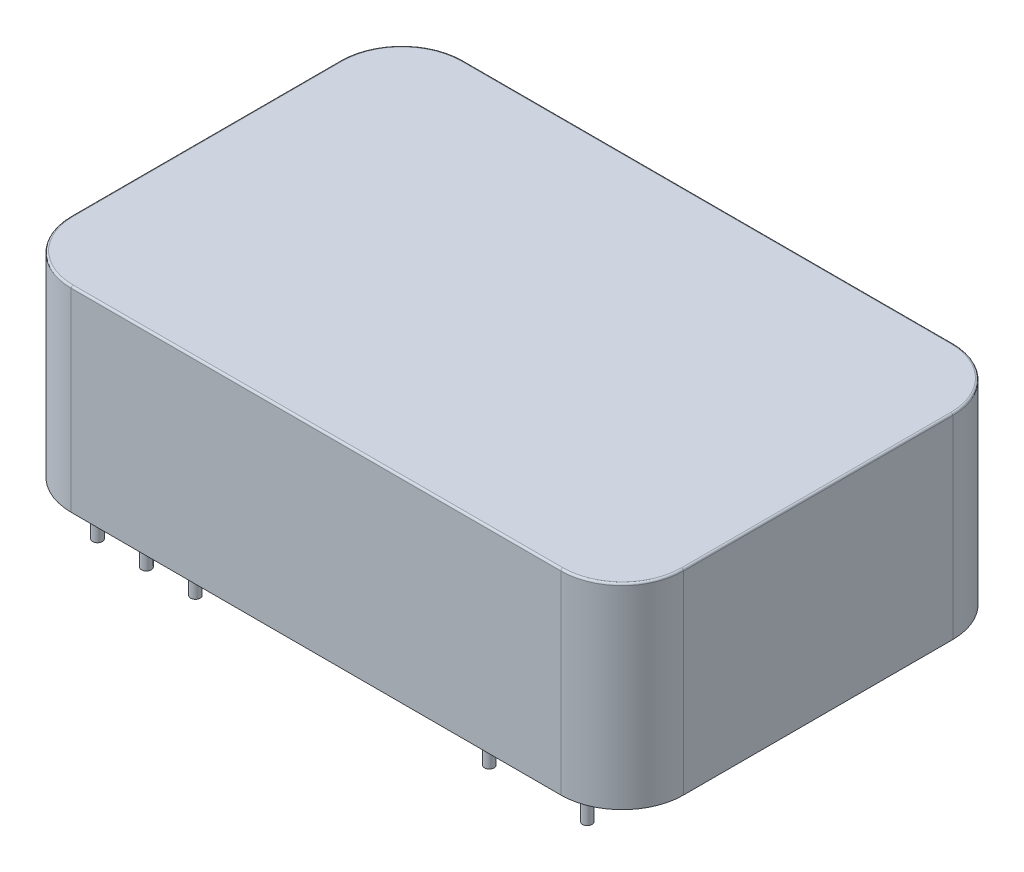
ISO-10303-21;
HEADER;
FILE_DESCRIPTION(('STEP AP214'),'2;1');
FILE_NAME('part.step','',(''),(''),'','','');
FILE_SCHEMA(('AUTOMOTIVE_DESIGN { 1 0 10303 214 1 1 1 1 }'));
ENDSEC;
DATA;
#1=APPLICATION_CONTEXT('core data for automotive mechanical design processes');
#2=APPLICATION_PROTOCOL_DEFINITION('international standard','automotive_design',2000,#1);
#3=PRODUCT_CONTEXT('',#1,'mechanical');
#4=PRODUCT('Part','Part','',(#3));
#5=PRODUCT_RELATED_PRODUCT_CATEGORY('part','',(#4));
#6=PRODUCT_DEFINITION_FORMATION('','',#4);
#7=PRODUCT_DEFINITION_CONTEXT('part definition',#1,'design');
#8=PRODUCT_DEFINITION('design','',#6,#7);
#9=PRODUCT_DEFINITION_SHAPE('','',#8);
#10=(LENGTH_UNIT() NAMED_UNIT(*) SI_UNIT(.MILLI.,.METRE.));
#11=(NAMED_UNIT(*) PLANE_ANGLE_UNIT() SI_UNIT($,.RADIAN.));
#12=(NAMED_UNIT(*) SI_UNIT($,.STERADIAN.) SOLID_ANGLE_UNIT());
#13=UNCERTAINTY_MEASURE_WITH_UNIT(LENGTH_MEASURE(1.E-05),#10,'distance_accuracy_value','');
#14=(GEOMETRIC_REPRESENTATION_CONTEXT(3) GLOBAL_UNCERTAINTY_ASSIGNED_CONTEXT((#13)) GLOBAL_UNIT_ASSIGNED_CONTEXT((#10,
#11,#12)) REPRESENTATION_CONTEXT('',''));
#15=CARTESIAN_POINT('',(0.,0.,0.));
#16=DIRECTION('',(0.,0.,1.));
#17=DIRECTION('',(1.,0.,0.));
#18=AXIS2_PLACEMENT_3D('',#15,#16,#17);
#19=CARTESIAN_POINT('',(-15.875,10.16,-10.16));
#20=DIRECTION('',(1.,0.,0.));
#21=DIRECTION('',(0.,0.,-1.));
#22=AXIS2_PLACEMENT_3D('',#19,#20,#21);
#23=PLANE('',#22);
#24=DIRECTION('',(0.,-1.,0.));
#25=VECTOR('',#24,1.);
#26=CARTESIAN_POINT('',(-15.875,10.16,6.98));
#27=LINE('',#26,#25);
#28=CARTESIAN_POINT('',(-15.875,0.,6.98));
#29=VERTEX_POINT('',#28);
#30=CARTESIAN_POINT('',(-15.875,10.06,6.98));
#31=VERTEX_POINT('',#30);
#32=EDGE_CURVE('E181',#29,#31,#27,.F.);
#33=ORIENTED_EDGE('',*,*,#32,.T.);
#34=DIRECTION('',(0.,0.,1.));
#35=VECTOR('',#34,1.);
#36=CARTESIAN_POINT('',(-15.875,10.06,-10.16));
#37=LINE('',#36,#35);
#38=CARTESIAN_POINT('',(-15.875,10.06,-6.98));
#39=VERTEX_POINT('',#38);
#40=EDGE_CURVE('E223',#31,#39,#37,.F.);
#41=ORIENTED_EDGE('',*,*,#40,.T.);
#42=DIRECTION('',(0.,-1.,0.));
#43=VECTOR('',#42,1.);
#44=CARTESIAN_POINT('',(-15.875,10.16,-6.98));
#45=LINE('',#44,#43);
#46=CARTESIAN_POINT('',(-15.875,0.,-6.98));
#47=VERTEX_POINT('',#46);
#48=EDGE_CURVE('E185',#39,#47,#45,.T.);
#49=ORIENTED_EDGE('',*,*,#48,.T.);
#50=DIRECTION('',(0.,0.,1.));
#51=VECTOR('',#50,1.);
#52=CARTESIAN_POINT('',(-15.875,0.,-10.16));
#53=LINE('',#52,#51);
#54=EDGE_CURVE('E338',#47,#29,#53,.T.);
#55=ORIENTED_EDGE('',*,*,#54,.T.);
#56=EDGE_LOOP('',(#33,#41,#49,#55));
#57=FACE_BOUND('',#56,.T.);
#58=ADVANCED_FACE('F39',(#57),#23,.F.);
#59=CARTESIAN_POINT('',(15.875,10.16,10.16));
#60=DIRECTION('',(0.,0.,-1.));
#61=DIRECTION('',(-1.,0.,0.));
#62=AXIS2_PLACEMENT_3D('',#59,#60,#61);
#63=PLANE('',#62);
#64=DIRECTION('',(0.,-1.,0.));
#65=VECTOR('',#64,1.);
#66=CARTESIAN_POINT('',(12.695,10.16,10.16));
#67=LINE('',#66,#65);
#68=CARTESIAN_POINT('',(12.695,0.,10.16));
#69=VERTEX_POINT('',#68);
#70=CARTESIAN_POINT('',(12.695,10.06,10.16));
#71=VERTEX_POINT('',#70);
#72=EDGE_CURVE('E177',#69,#71,#67,.F.);
#73=ORIENTED_EDGE('',*,*,#72,.T.);
#74=DIRECTION('',(1.,0.,0.));
#75=VECTOR('',#74,1.);
#76=CARTESIAN_POINT('',(15.875,10.06,10.16));
#77=LINE('',#76,#75);
#78=CARTESIAN_POINT('',(-12.695,10.06,10.16));
#79=VERTEX_POINT('',#78);
#80=EDGE_CURVE('E217',#71,#79,#77,.F.);
#81=ORIENTED_EDGE('',*,*,#80,.T.);
#82=DIRECTION('',(0.,-1.,0.));
#83=VECTOR('',#82,1.);
#84=CARTESIAN_POINT('',(-12.695,10.16,10.16));
#85=LINE('',#84,#83);
#86=CARTESIAN_POINT('',(-12.695,0.,10.16));
#87=VERTEX_POINT('',#86);
#88=EDGE_CURVE('E174',#79,#87,#85,.T.);
#89=ORIENTED_EDGE('',*,*,#88,.T.);
#90=DIRECTION('',(1.,0.,0.));
#91=VECTOR('',#90,1.);
#92=CARTESIAN_POINT('',(15.875,0.,10.16));
#93=LINE('',#92,#91);
#94=EDGE_CURVE('E160',#87,#69,#93,.T.);
#95=ORIENTED_EDGE('',*,*,#94,.T.);
#96=EDGE_LOOP('',(#73,#81,#89,#95));
#97=FACE_BOUND('',#96,.T.);
#98=ADVANCED_FACE('F349',(#97),#63,.F.);
#99=CARTESIAN_POINT('',(15.875,10.16,-10.16));
#100=DIRECTION('',(-1.,0.,0.));
#101=DIRECTION('',(0.,0.,1.));
#102=AXIS2_PLACEMENT_3D('',#99,#100,#101);
#103=PLANE('',#102);
#104=DIRECTION('',(0.,-1.,0.));
#105=VECTOR('',#104,1.);
#106=CARTESIAN_POINT('',(15.875,10.16,-6.98));
#107=LINE('',#106,#105);
#108=CARTESIAN_POINT('',(15.875,0.,-6.98));
#109=VERTEX_POINT('',#108);
#110=CARTESIAN_POINT('',(15.875,10.06,-6.98));
#111=VERTEX_POINT('',#110);
#112=EDGE_CURVE('E142',#109,#111,#107,.F.);
#113=ORIENTED_EDGE('',*,*,#112,.T.);
#114=DIRECTION('',(0.,0.,-1.));
#115=VECTOR('',#114,1.);
#116=CARTESIAN_POINT('',(15.875,10.06,-10.16));
#117=LINE('',#116,#115);
#118=CARTESIAN_POINT('',(15.875,10.06,6.98));
#119=VERTEX_POINT('',#118);
#120=EDGE_CURVE('E11',#111,#119,#117,.F.);
#121=ORIENTED_EDGE('',*,*,#120,.T.);
#122=DIRECTION('',(0.,-1.,0.));
#123=VECTOR('',#122,1.);
#124=CARTESIAN_POINT('',(15.875,10.16,6.98));
#125=LINE('',#124,#123);
#126=CARTESIAN_POINT('',(15.875,0.,6.98));
#127=VERTEX_POINT('',#126);
#128=EDGE_CURVE('E147',#119,#127,#125,.T.);
#129=ORIENTED_EDGE('',*,*,#128,.T.);
#130=DIRECTION('',(0.,0.,-1.));
#131=VECTOR('',#130,1.);
#132=CARTESIAN_POINT('',(15.875,0.,-10.16));
#133=LINE('',#132,#131);
#134=EDGE_CURVE('E155',#127,#109,#133,.T.);
#135=ORIENTED_EDGE('',*,*,#134,.T.);
#136=EDGE_LOOP('',(#113,#121,#129,#135));
#137=FACE_BOUND('',#136,.T.);
#138=ADVANCED_FACE('F407',(#137),#103,.F.);
#139=CARTESIAN_POINT('',(15.875,10.16,-10.16));
#140=DIRECTION('',(0.,0.,1.));
#141=DIRECTION('',(1.,0.,0.));
#142=AXIS2_PLACEMENT_3D('',#139,#140,#141);
#143=PLANE('',#142);
#144=DIRECTION('',(0.,-1.,0.));
#145=VECTOR('',#144,1.);
#146=CARTESIAN_POINT('',(-12.695,10.16,-10.16));
#147=LINE('',#146,#145);
#148=CARTESIAN_POINT('',(-12.695,0.,-10.16));
#149=VERTEX_POINT('',#148);
#150=CARTESIAN_POINT('',(-12.695,10.06,-10.16));
#151=VERTEX_POINT('',#150);
#152=EDGE_CURVE('E138',#149,#151,#147,.F.);
#153=ORIENTED_EDGE('',*,*,#152,.T.);
#154=DIRECTION('',(-1.,0.,0.));
#155=VECTOR('',#154,1.);
#156=CARTESIAN_POINT('',(15.875,10.06,-10.16));
#157=LINE('',#156,#155);
#158=CARTESIAN_POINT('',(12.695,10.06,-10.16));
#159=VERTEX_POINT('',#158);
#160=EDGE_CURVE('E64',#151,#159,#157,.F.);
#161=ORIENTED_EDGE('',*,*,#160,.T.);
#162=DIRECTION('',(0.,-1.,0.));
#163=VECTOR('',#162,1.);
#164=CARTESIAN_POINT('',(12.695,10.16,-10.16));
#165=LINE('',#164,#163);
#166=CARTESIAN_POINT('',(12.695,0.,-10.16));
#167=VERTEX_POINT('',#166);
#168=EDGE_CURVE('E129',#159,#167,#165,.T.);
#169=ORIENTED_EDGE('',*,*,#168,.T.);
#170=DIRECTION('',(-1.,0.,0.));
#171=VECTOR('',#170,1.);
#172=CARTESIAN_POINT('',(15.875,0.,-10.16));
#173=LINE('',#172,#171);
#174=EDGE_CURVE('E133',#167,#149,#173,.T.);
#175=ORIENTED_EDGE('',*,*,#174,.T.);
#176=EDGE_LOOP('',(#153,#161,#169,#175));
#177=FACE_BOUND('',#176,.T.);
#178=ADVANCED_FACE('F131',(#177),#143,.F.);
#179=CARTESIAN_POINT('',(0.,10.16,0.));
#180=DIRECTION('',(0.,-1.,0.));
#181=DIRECTION('',(0.,0.,-1.));
#182=AXIS2_PLACEMENT_3D('',#179,#180,#181);
#183=PLANE('',#182);
#184=DIRECTION('',(1.,0.,0.));
#185=VECTOR('',#184,1.);
#186=CARTESIAN_POINT('',(0.,10.16,10.06));
#187=LINE('',#186,#185);
#188=CARTESIAN_POINT('',(-12.695,10.16,10.06));
#189=VERTEX_POINT('',#188);
#190=CARTESIAN_POINT('',(12.695,10.16,10.06));
#191=VERTEX_POINT('',#190);
#192=EDGE_CURVE('E206',#189,#191,#187,.T.);
#193=ORIENTED_EDGE('',*,*,#192,.T.);
#194=CARTESIAN_POINT('',(12.695,10.16,6.98));
#195=DIRECTION('',(0.,-1.,0.));
#196=DIRECTION('',(0.,0.,-1.));
#197=AXIS2_PLACEMENT_3D('',#194,#195,#196);
#198=CIRCLE('',#197,3.08);
#199=CARTESIAN_POINT('',(15.775,10.16,6.98));
#200=VERTEX_POINT('',#199);
#201=EDGE_CURVE('E209',#191,#200,#198,.F.);
#202=ORIENTED_EDGE('',*,*,#201,.T.);
#203=DIRECTION('',(0.,0.,-1.));
#204=VECTOR('',#203,1.);
#205=CARTESIAN_POINT('',(15.775,10.16,0.));
#206=LINE('',#205,#204);
#207=CARTESIAN_POINT('',(15.775,10.16,-6.98));
#208=VERTEX_POINT('',#207);
#209=EDGE_CURVE('E188',#200,#208,#206,.T.);
#210=ORIENTED_EDGE('',*,*,#209,.T.);
#211=CARTESIAN_POINT('',(12.695,10.16,-6.98));
#212=DIRECTION('',(0.,-1.,0.));
#213=DIRECTION('',(0.,0.,-1.));
#214=AXIS2_PLACEMENT_3D('',#211,#212,#213);
#215=CIRCLE('',#214,3.08);
#216=CARTESIAN_POINT('',(12.695,10.16,-10.06));
#217=VERTEX_POINT('',#216);
#218=EDGE_CURVE('E191',#208,#217,#215,.F.);
#219=ORIENTED_EDGE('',*,*,#218,.T.);
#220=DIRECTION('',(-1.,0.,0.));
#221=VECTOR('',#220,1.);
#222=CARTESIAN_POINT('',(0.,10.16,-10.06));
#223=LINE('',#222,#221);
#224=CARTESIAN_POINT('',(-12.695,10.16,-10.06));
#225=VERTEX_POINT('',#224);
#226=EDGE_CURVE('E194',#217,#225,#223,.T.);
#227=ORIENTED_EDGE('',*,*,#226,.T.);
#228=CARTESIAN_POINT('',(-12.695,10.16,-6.98));
#229=DIRECTION('',(0.,-1.,0.));
#230=DIRECTION('',(0.,0.,-1.));
#231=AXIS2_PLACEMENT_3D('',#228,#229,#230);
#232=CIRCLE('',#231,3.08);
#233=CARTESIAN_POINT('',(-15.775,10.16,-6.98));
#234=VERTEX_POINT('',#233);
#235=EDGE_CURVE('E197',#225,#234,#232,.F.);
#236=ORIENTED_EDGE('',*,*,#235,.T.);
#237=DIRECTION('',(0.,0.,1.));
#238=VECTOR('',#237,1.);
#239=CARTESIAN_POINT('',(-15.775,10.16,0.));
#240=LINE('',#239,#238);
#241=CARTESIAN_POINT('',(-15.775,10.16,6.98));
#242=VERTEX_POINT('',#241);
#243=EDGE_CURVE('E200',#234,#242,#240,.T.);
#244=ORIENTED_EDGE('',*,*,#243,.T.);
#245=CARTESIAN_POINT('',(-12.695,10.16,6.98));
#246=DIRECTION('',(0.,-1.,0.));
#247=DIRECTION('',(0.,0.,-1.));
#248=AXIS2_PLACEMENT_3D('',#245,#246,#247);
#249=CIRCLE('',#248,3.08);
#250=EDGE_CURVE('E203',#242,#189,#249,.F.);
#251=ORIENTED_EDGE('',*,*,#250,.T.);
#252=EDGE_LOOP('',(#193,#202,#210,#219,#227,#236,#244,#251));
#253=FACE_BOUND('',#252,.T.);
#254=ADVANCED_FACE('F370',(#253),#183,.F.);
#255=CARTESIAN_POINT('',(0.,0.,0.));
#256=DIRECTION('',(0.,-1.,0.));
#257=DIRECTION('',(0.,0.,-1.));
#258=AXIS2_PLACEMENT_3D('',#255,#256,#257);
#259=PLANE('',#258);
#260=CARTESIAN_POINT('',(-11.335,0.,-7.62));
#261=DIRECTION('',(0.,-1.,0.));
#262=DIRECTION('',(0.,0.,-1.));
#263=AXIS2_PLACEMENT_3D('',#260,#261,#262);
#264=CIRCLE('',#263,0.25);
#265=CARTESIAN_POINT('',(-11.335,0.,-7.87));
#266=VERTEX_POINT('',#265);
#267=EDGE_CURVE('E262',#266,#266,#264,.T.);
#268=ORIENTED_EDGE('',*,*,#267,.F.);
#269=EDGE_LOOP('',(#268));
#270=FACE_BOUND('',#269,.T.);
#271=CARTESIAN_POINT('',(-8.79500000000001,0.,-7.62));
#272=DIRECTION('',(0.,-1.,0.));
#273=DIRECTION('',(0.,0.,-1.));
#274=AXIS2_PLACEMENT_3D('',#271,#272,#273);
#275=CIRCLE('',#274,0.25);
#276=CARTESIAN_POINT('',(-8.79500000000001,0.,-7.87));
#277=VERTEX_POINT('',#276);
#278=EDGE_CURVE('E275',#277,#277,#275,.T.);
#279=ORIENTED_EDGE('',*,*,#278,.F.);
#280=EDGE_LOOP('',(#279));
#281=FACE_BOUND('',#280,.T.);
#282=CARTESIAN_POINT('',(6.44499999999999,0.,-7.62));
#283=DIRECTION('',(0.,-1.,0.));
#284=DIRECTION('',(0.,0.,-1.));
#285=AXIS2_PLACEMENT_3D('',#282,#283,#284);
#286=CIRCLE('',#285,0.25);
#287=CARTESIAN_POINT('',(6.44499999999999,0.,-7.87));
#288=VERTEX_POINT('',#287);
#289=EDGE_CURVE('E282',#288,#288,#286,.T.);
#290=ORIENTED_EDGE('',*,*,#289,.F.);
#291=EDGE_LOOP('',(#290));
#292=FACE_BOUND('',#291,.T.);
#293=CARTESIAN_POINT('',(11.525,0.,-7.62));
#294=DIRECTION('',(0.,-1.,0.));
#295=DIRECTION('',(0.,0.,-1.));
#296=AXIS2_PLACEMENT_3D('',#293,#294,#295);
#297=CIRCLE('',#296,0.25);
#298=CARTESIAN_POINT('',(11.525,0.,-7.87));
#299=VERTEX_POINT('',#298);
#300=EDGE_CURVE('E290',#299,#299,#297,.T.);
#301=ORIENTED_EDGE('',*,*,#300,.F.);
#302=EDGE_LOOP('',(#301));
#303=FACE_BOUND('',#302,.T.);
#304=CARTESIAN_POINT('',(11.525,0.,7.62));
#305=DIRECTION('',(0.,-1.,0.));
#306=DIRECTION('',(0.,0.,-1.));
#307=AXIS2_PLACEMENT_3D('',#304,#305,#306);
#308=CIRCLE('',#307,0.25);
#309=CARTESIAN_POINT('',(11.525,0.,7.37));
#310=VERTEX_POINT('',#309);
#311=EDGE_CURVE('E298',#310,#310,#308,.T.);
#312=ORIENTED_EDGE('',*,*,#311,.F.);
#313=EDGE_LOOP('',(#312));
#314=FACE_BOUND('',#313,.T.);
#315=CARTESIAN_POINT('',(6.44499999999999,0.,7.62));
#316=DIRECTION('',(0.,-1.,0.));
#317=DIRECTION('',(0.,0.,-1.));
#318=AXIS2_PLACEMENT_3D('',#315,#316,#317);
#319=CIRCLE('',#318,0.25);
#320=CARTESIAN_POINT('',(6.44499999999999,0.,7.37));
#321=VERTEX_POINT('',#320);
#322=EDGE_CURVE('E306',#321,#321,#319,.T.);
#323=ORIENTED_EDGE('',*,*,#322,.F.);
#324=EDGE_LOOP('',(#323));
#325=FACE_BOUND('',#324,.T.);
#326=CARTESIAN_POINT('',(-8.79500000000001,0.,7.62));
#327=DIRECTION('',(0.,-1.,0.));
#328=DIRECTION('',(0.,0.,-1.));
#329=AXIS2_PLACEMENT_3D('',#326,#327,#328);
#330=CIRCLE('',#329,0.25);
#331=CARTESIAN_POINT('',(-8.79500000000001,0.,7.37));
#332=VERTEX_POINT('',#331);
#333=EDGE_CURVE('E314',#332,#332,#330,.T.);
#334=ORIENTED_EDGE('',*,*,#333,.F.);
#335=EDGE_LOOP('',(#334));
#336=FACE_BOUND('',#335,.T.);
#337=CARTESIAN_POINT('',(-11.335,0.,7.62));
#338=DIRECTION('',(0.,-1.,0.));
#339=DIRECTION('',(0.,0.,-1.));
#340=AXIS2_PLACEMENT_3D('',#337,#338,#339);
#341=CIRCLE('',#340,0.25);
#342=CARTESIAN_POINT('',(-11.335,0.,7.37));
#343=VERTEX_POINT('',#342);
#344=EDGE_CURVE('E322',#343,#343,#341,.T.);
#345=ORIENTED_EDGE('',*,*,#344,.F.);
#346=EDGE_LOOP('',(#345));
#347=FACE_BOUND('',#346,.T.);
#348=CARTESIAN_POINT('',(-13.875,0.,7.62));
#349=DIRECTION('',(0.,-1.,0.));
#350=DIRECTION('',(0.,0.,-1.));
#351=AXIS2_PLACEMENT_3D('',#348,#349,#350);
#352=CIRCLE('',#351,0.25);
#353=CARTESIAN_POINT('',(-13.875,0.,7.37));
#354=VERTEX_POINT('',#353);
#355=EDGE_CURVE('E330',#354,#354,#352,.T.);
#356=ORIENTED_EDGE('',*,*,#355,.F.);
#357=EDGE_LOOP('',(#356));
#358=FACE_BOUND('',#357,.T.);
#359=ORIENTED_EDGE('',*,*,#174,.F.);
#360=CARTESIAN_POINT('',(12.695,0.,-6.98));
#361=DIRECTION('',(0.,-1.,0.));
#362=DIRECTION('',(0.,0.,-1.));
#363=AXIS2_PLACEMENT_3D('',#360,#361,#362);
#364=CIRCLE('',#363,3.18);
#365=EDGE_CURVE('E140',#167,#109,#364,.T.);
#366=ORIENTED_EDGE('',*,*,#365,.T.);
#367=ORIENTED_EDGE('',*,*,#134,.F.);
#368=CARTESIAN_POINT('',(12.695,0.,6.98));
#369=DIRECTION('',(0.,-1.,0.));
#370=DIRECTION('',(0.,0.,-1.));
#371=AXIS2_PLACEMENT_3D('',#368,#369,#370);
#372=CIRCLE('',#371,3.18);
#373=EDGE_CURVE('E148',#127,#69,#372,.T.);
#374=ORIENTED_EDGE('',*,*,#373,.T.);
#375=ORIENTED_EDGE('',*,*,#94,.F.);
#376=CARTESIAN_POINT('',(-12.695,0.,6.98));
#377=DIRECTION('',(0.,-1.,0.));
#378=DIRECTION('',(0.,0.,-1.));
#379=AXIS2_PLACEMENT_3D('',#376,#377,#378);
#380=CIRCLE('',#379,3.18);
#381=EDGE_CURVE('E137',#87,#29,#380,.T.);
#382=ORIENTED_EDGE('',*,*,#381,.T.);
#383=ORIENTED_EDGE('',*,*,#54,.F.);
#384=CARTESIAN_POINT('',(-12.695,0.,-6.98));
#385=DIRECTION('',(0.,-1.,0.));
#386=DIRECTION('',(0.,0.,-1.));
#387=AXIS2_PLACEMENT_3D('',#384,#385,#386);
#388=CIRCLE('',#387,3.18);
#389=EDGE_CURVE('E153',#47,#149,#388,.T.);
#390=ORIENTED_EDGE('',*,*,#389,.T.);
#391=EDGE_LOOP('',(#359,#366,#367,#374,#375,#382,#383,#390));
#392=FACE_BOUND('',#391,.T.);
#393=ADVANCED_FACE('F150',(#270,#281,#292,#303,#314,#325,#336,#347,#358,#392),#259,.T.);
#394=CARTESIAN_POINT('',(-13.875,-3.05,7.62));
#395=DIRECTION('',(0.,1.,0.));
#396=DIRECTION('',(0.,0.,1.));
#397=AXIS2_PLACEMENT_3D('',#394,#395,#396);
#398=CYLINDRICAL_SURFACE('',#397,0.25);
#399=CARTESIAN_POINT('',(-13.875,-3.05,7.62));
#400=DIRECTION('',(0.,-1.,0.));
#401=DIRECTION('',(0.,0.,-1.));
#402=AXIS2_PLACEMENT_3D('',#399,#400,#401);
#403=CIRCLE('',#402,0.25);
#404=CARTESIAN_POINT('',(-13.875,-3.05,7.37));
#405=VERTEX_POINT('',#404);
#406=EDGE_CURVE('E334',#405,#405,#403,.T.);
#407=ORIENTED_EDGE('',*,*,#406,.F.);
#408=EDGE_LOOP('',(#407));
#409=FACE_BOUND('',#408,.T.);
#410=ORIENTED_EDGE('',*,*,#355,.T.);
#411=EDGE_LOOP('',(#410));
#412=FACE_BOUND('',#411,.T.);
#413=ADVANCED_FACE('F641',(#409,#412),#398,.T.);
#414=CARTESIAN_POINT('',(-13.875,-3.05,7.62));
#415=DIRECTION('',(0.,-1.,0.));
#416=DIRECTION('',(0.,0.,-1.));
#417=AXIS2_PLACEMENT_3D('',#414,#415,#416);
#418=PLANE('',#417);
#419=ORIENTED_EDGE('',*,*,#406,.T.);
#420=EDGE_LOOP('',(#419));
#421=FACE_BOUND('',#420,.T.);
#422=ADVANCED_FACE('F632',(#421),#418,.T.);
#423=CARTESIAN_POINT('',(-11.335,-3.05,7.62));
#424=DIRECTION('',(0.,1.,0.));
#425=DIRECTION('',(0.,0.,1.));
#426=AXIS2_PLACEMENT_3D('',#423,#424,#425);
#427=CYLINDRICAL_SURFACE('',#426,0.25);
#428=CARTESIAN_POINT('',(-11.335,-3.05,7.62));
#429=DIRECTION('',(0.,-1.,0.));
#430=DIRECTION('',(0.,0.,-1.));
#431=AXIS2_PLACEMENT_3D('',#428,#429,#430);
#432=CIRCLE('',#431,0.25);
#433=CARTESIAN_POINT('',(-11.335,-3.05,7.37));
#434=VERTEX_POINT('',#433);
#435=EDGE_CURVE('E326',#434,#434,#432,.T.);
#436=ORIENTED_EDGE('',*,*,#435,.F.);
#437=EDGE_LOOP('',(#436));
#438=FACE_BOUND('',#437,.T.);
#439=ORIENTED_EDGE('',*,*,#344,.T.);
#440=EDGE_LOOP('',(#439));
#441=FACE_BOUND('',#440,.T.);
#442=ADVANCED_FACE('F623',(#438,#441),#427,.T.);
#443=CARTESIAN_POINT('',(-11.335,-3.05,7.62));
#444=DIRECTION('',(0.,-1.,0.));
#445=DIRECTION('',(0.,0.,-1.));
#446=AXIS2_PLACEMENT_3D('',#443,#444,#445);
#447=PLANE('',#446);
#448=ORIENTED_EDGE('',*,*,#435,.T.);
#449=EDGE_LOOP('',(#448));
#450=FACE_BOUND('',#449,.T.);
#451=ADVANCED_FACE('F614',(#450),#447,.T.);
#452=CARTESIAN_POINT('',(-8.79500000000001,-3.05,7.62));
#453=DIRECTION('',(0.,1.,0.));
#454=DIRECTION('',(0.,0.,1.));
#455=AXIS2_PLACEMENT_3D('',#452,#453,#454);
#456=CYLINDRICAL_SURFACE('',#455,0.25);
#457=CARTESIAN_POINT('',(-8.79500000000001,-3.05,7.62));
#458=DIRECTION('',(0.,-1.,0.));
#459=DIRECTION('',(0.,0.,-1.));
#460=AXIS2_PLACEMENT_3D('',#457,#458,#459);
#461=CIRCLE('',#460,0.25);
#462=CARTESIAN_POINT('',(-8.79500000000001,-3.05,7.37));
#463=VERTEX_POINT('',#462);
#464=EDGE_CURVE('E318',#463,#463,#461,.T.);
#465=ORIENTED_EDGE('',*,*,#464,.F.);
#466=EDGE_LOOP('',(#465));
#467=FACE_BOUND('',#466,.T.);
#468=ORIENTED_EDGE('',*,*,#333,.T.);
#469=EDGE_LOOP('',(#468));
#470=FACE_BOUND('',#469,.T.);
#471=ADVANCED_FACE('F605',(#467,#470),#456,.T.);
#472=CARTESIAN_POINT('',(-8.79500000000001,-3.05,7.62));
#473=DIRECTION('',(0.,-1.,0.));
#474=DIRECTION('',(0.,0.,-1.));
#475=AXIS2_PLACEMENT_3D('',#472,#473,#474);
#476=PLANE('',#475);
#477=ORIENTED_EDGE('',*,*,#464,.T.);
#478=EDGE_LOOP('',(#477));
#479=FACE_BOUND('',#478,.T.);
#480=ADVANCED_FACE('F596',(#479),#476,.T.);
#481=CARTESIAN_POINT('',(6.44499999999999,-3.05,7.62));
#482=DIRECTION('',(0.,1.,0.));
#483=DIRECTION('',(0.,0.,1.));
#484=AXIS2_PLACEMENT_3D('',#481,#482,#483);
#485=CYLINDRICAL_SURFACE('',#484,0.25);
#486=CARTESIAN_POINT('',(6.44499999999999,-3.05,7.62));
#487=DIRECTION('',(0.,-1.,0.));
#488=DIRECTION('',(0.,0.,-1.));
#489=AXIS2_PLACEMENT_3D('',#486,#487,#488);
#490=CIRCLE('',#489,0.25);
#491=CARTESIAN_POINT('',(6.44499999999999,-3.05,7.37));
#492=VERTEX_POINT('',#491);
#493=EDGE_CURVE('E310',#492,#492,#490,.T.);
#494=ORIENTED_EDGE('',*,*,#493,.F.);
#495=EDGE_LOOP('',(#494));
#496=FACE_BOUND('',#495,.T.);
#497=ORIENTED_EDGE('',*,*,#322,.T.);
#498=EDGE_LOOP('',(#497));
#499=FACE_BOUND('',#498,.T.);
#500=ADVANCED_FACE('F587',(#496,#499),#485,.T.);
#501=CARTESIAN_POINT('',(6.44499999999999,-3.05,7.62));
#502=DIRECTION('',(0.,-1.,0.));
#503=DIRECTION('',(0.,0.,-1.));
#504=AXIS2_PLACEMENT_3D('',#501,#502,#503);
#505=PLANE('',#504);
#506=ORIENTED_EDGE('',*,*,#493,.T.);
#507=EDGE_LOOP('',(#506));
#508=FACE_BOUND('',#507,.T.);
#509=ADVANCED_FACE('F578',(#508),#505,.T.);
#510=CARTESIAN_POINT('',(11.525,-3.05,7.62));
#511=DIRECTION('',(0.,1.,0.));
#512=DIRECTION('',(0.,0.,1.));
#513=AXIS2_PLACEMENT_3D('',#510,#511,#512);
#514=CYLINDRICAL_SURFACE('',#513,0.25);
#515=CARTESIAN_POINT('',(11.525,-3.05,7.62));
#516=DIRECTION('',(0.,-1.,0.));
#517=DIRECTION('',(0.,0.,-1.));
#518=AXIS2_PLACEMENT_3D('',#515,#516,#517);
#519=CIRCLE('',#518,0.25);
#520=CARTESIAN_POINT('',(11.525,-3.05,7.37));
#521=VERTEX_POINT('',#520);
#522=EDGE_CURVE('E302',#521,#521,#519,.T.);
#523=ORIENTED_EDGE('',*,*,#522,.F.);
#524=EDGE_LOOP('',(#523));
#525=FACE_BOUND('',#524,.T.);
#526=ORIENTED_EDGE('',*,*,#311,.T.);
#527=EDGE_LOOP('',(#526));
#528=FACE_BOUND('',#527,.T.);
#529=ADVANCED_FACE('F569',(#525,#528),#514,.T.);
#530=CARTESIAN_POINT('',(11.525,-3.05,7.62));
#531=DIRECTION('',(0.,-1.,0.));
#532=DIRECTION('',(0.,0.,-1.));
#533=AXIS2_PLACEMENT_3D('',#530,#531,#532);
#534=PLANE('',#533);
#535=ORIENTED_EDGE('',*,*,#522,.T.);
#536=EDGE_LOOP('',(#535));
#537=FACE_BOUND('',#536,.T.);
#538=ADVANCED_FACE('F560',(#537),#534,.T.);
#539=CARTESIAN_POINT('',(11.525,-3.05,-7.62));
#540=DIRECTION('',(0.,1.,0.));
#541=DIRECTION('',(0.,0.,1.));
#542=AXIS2_PLACEMENT_3D('',#539,#540,#541);
#543=CYLINDRICAL_SURFACE('',#542,0.25);
#544=CARTESIAN_POINT('',(11.525,-3.05,-7.62));
#545=DIRECTION('',(0.,-1.,0.));
#546=DIRECTION('',(0.,0.,-1.));
#547=AXIS2_PLACEMENT_3D('',#544,#545,#546);
#548=CIRCLE('',#547,0.25);
#549=CARTESIAN_POINT('',(11.525,-3.05,-7.87));
#550=VERTEX_POINT('',#549);
#551=EDGE_CURVE('E294',#550,#550,#548,.T.);
#552=ORIENTED_EDGE('',*,*,#551,.F.);
#553=EDGE_LOOP('',(#552));
#554=FACE_BOUND('',#553,.T.);
#555=ORIENTED_EDGE('',*,*,#300,.T.);
#556=EDGE_LOOP('',(#555));
#557=FACE_BOUND('',#556,.T.);
#558=ADVANCED_FACE('F551',(#554,#557),#543,.T.);
#559=CARTESIAN_POINT('',(11.525,-3.05,-7.62));
#560=DIRECTION('',(0.,-1.,0.));
#561=DIRECTION('',(0.,0.,-1.));
#562=AXIS2_PLACEMENT_3D('',#559,#560,#561);
#563=PLANE('',#562);
#564=ORIENTED_EDGE('',*,*,#551,.T.);
#565=EDGE_LOOP('',(#564));
#566=FACE_BOUND('',#565,.T.);
#567=ADVANCED_FACE('F542',(#566),#563,.T.);
#568=CARTESIAN_POINT('',(6.44499999999999,-3.05,-7.62));
#569=DIRECTION('',(0.,1.,0.));
#570=DIRECTION('',(0.,0.,1.));
#571=AXIS2_PLACEMENT_3D('',#568,#569,#570);
#572=CYLINDRICAL_SURFACE('',#571,0.25);
#573=CARTESIAN_POINT('',(6.44499999999999,-3.05,-7.62));
#574=DIRECTION('',(0.,-1.,0.));
#575=DIRECTION('',(0.,0.,-1.));
#576=AXIS2_PLACEMENT_3D('',#573,#574,#575);
#577=CIRCLE('',#576,0.25);
#578=CARTESIAN_POINT('',(6.44499999999999,-3.05,-7.87));
#579=VERTEX_POINT('',#578);
#580=EDGE_CURVE('E286',#579,#579,#577,.T.);
#581=ORIENTED_EDGE('',*,*,#580,.F.);
#582=EDGE_LOOP('',(#581));
#583=FACE_BOUND('',#582,.T.);
#584=ORIENTED_EDGE('',*,*,#289,.T.);
#585=EDGE_LOOP('',(#584));
#586=FACE_BOUND('',#585,.T.);
#587=ADVANCED_FACE('F533',(#583,#586),#572,.T.);
#588=CARTESIAN_POINT('',(6.44499999999999,-3.05,-7.62));
#589=DIRECTION('',(0.,-1.,0.));
#590=DIRECTION('',(0.,0.,-1.));
#591=AXIS2_PLACEMENT_3D('',#588,#589,#590);
#592=PLANE('',#591);
#593=ORIENTED_EDGE('',*,*,#580,.T.);
#594=EDGE_LOOP('',(#593));
#595=FACE_BOUND('',#594,.T.);
#596=ADVANCED_FACE('F524',(#595),#592,.T.);
#597=CARTESIAN_POINT('',(-8.79500000000001,-3.05,-7.62));
#598=DIRECTION('',(0.,1.,0.));
#599=DIRECTION('',(0.,0.,1.));
#600=AXIS2_PLACEMENT_3D('',#597,#598,#599);
#601=CYLINDRICAL_SURFACE('',#600,0.25);
#602=CARTESIAN_POINT('',(-8.79500000000001,-3.05,-7.62));
#603=DIRECTION('',(0.,-1.,0.));
#604=DIRECTION('',(0.,0.,-1.));
#605=AXIS2_PLACEMENT_3D('',#602,#603,#604);
#606=CIRCLE('',#605,0.25);
#607=CARTESIAN_POINT('',(-8.79500000000001,-3.05,-7.87));
#608=VERTEX_POINT('',#607);
#609=EDGE_CURVE('E278',#608,#608,#606,.T.);
#610=ORIENTED_EDGE('',*,*,#609,.F.);
#611=EDGE_LOOP('',(#610));
#612=FACE_BOUND('',#611,.T.);
#613=ORIENTED_EDGE('',*,*,#278,.T.);
#614=EDGE_LOOP('',(#613));
#615=FACE_BOUND('',#614,.T.);
#616=ADVANCED_FACE('F515',(#612,#615),#601,.T.);
#617=CARTESIAN_POINT('',(-8.79500000000001,-3.05,-7.62));
#618=DIRECTION('',(0.,-1.,0.));
#619=DIRECTION('',(0.,0.,-1.));
#620=AXIS2_PLACEMENT_3D('',#617,#618,#619);
#621=PLANE('',#620);
#622=ORIENTED_EDGE('',*,*,#609,.T.);
#623=EDGE_LOOP('',(#622));
#624=FACE_BOUND('',#623,.T.);
#625=ADVANCED_FACE('F506',(#624),#621,.T.);
#626=CARTESIAN_POINT('',(-11.335,-3.05,-7.62));
#627=DIRECTION('',(0.,1.,0.));
#628=DIRECTION('',(0.,0.,1.));
#629=AXIS2_PLACEMENT_3D('',#626,#627,#628);
#630=CYLINDRICAL_SURFACE('',#629,0.25);
#631=CARTESIAN_POINT('',(-11.335,-3.05,-7.62));
#632=DIRECTION('',(0.,-1.,0.));
#633=DIRECTION('',(0.,0.,-1.));
#634=AXIS2_PLACEMENT_3D('',#631,#632,#633);
#635=CIRCLE('',#634,0.25);
#636=CARTESIAN_POINT('',(-11.335,-3.05,-7.87));
#637=VERTEX_POINT('',#636);
#638=EDGE_CURVE('E269',#637,#637,#635,.T.);
#639=ORIENTED_EDGE('',*,*,#638,.F.);
#640=EDGE_LOOP('',(#639));
#641=FACE_BOUND('',#640,.T.);
#642=ORIENTED_EDGE('',*,*,#267,.T.);
#643=EDGE_LOOP('',(#642));
#644=FACE_BOUND('',#643,.T.);
#645=ADVANCED_FACE('F496',(#641,#644),#630,.T.);
#646=CARTESIAN_POINT('',(-11.335,-3.05,-7.62));
#647=DIRECTION('',(0.,-1.,0.));
#648=DIRECTION('',(0.,0.,-1.));
#649=AXIS2_PLACEMENT_3D('',#646,#647,#648);
#650=PLANE('',#649);
#651=ORIENTED_EDGE('',*,*,#638,.T.);
#652=EDGE_LOOP('',(#651));
#653=FACE_BOUND('',#652,.T.);
#654=ADVANCED_FACE('F413',(#653),#650,.T.);
#655=CARTESIAN_POINT('',(12.695,10.16,-6.98));
#656=DIRECTION('',(0.,-1.,0.));
#657=DIRECTION('',(0.,0.,-1.));
#658=AXIS2_PLACEMENT_3D('',#655,#656,#657);
#659=CYLINDRICAL_SURFACE('',#658,3.18);
#660=ORIENTED_EDGE('',*,*,#168,.F.);
#661=CARTESIAN_POINT('',(12.695,10.06,-6.98));
#662=DIRECTION('',(0.,-1.,0.));
#663=DIRECTION('',(0.,0.,-1.));
#664=AXIS2_PLACEMENT_3D('',#661,#662,#663);
#665=CIRCLE('',#664,3.18);
#666=EDGE_CURVE('E49',#159,#111,#665,.T.);
#667=ORIENTED_EDGE('',*,*,#666,.T.);
#668=ORIENTED_EDGE('',*,*,#112,.F.);
#669=ORIENTED_EDGE('',*,*,#365,.F.);
#670=EDGE_LOOP('',(#660,#667,#668,#669));
#671=FACE_BOUND('',#670,.T.);
#672=ADVANCED_FACE('F141',(#671),#659,.T.);
#673=CARTESIAN_POINT('',(12.695,10.16,6.98));
#674=DIRECTION('',(0.,-1.,0.));
#675=DIRECTION('',(0.,0.,-1.));
#676=AXIS2_PLACEMENT_3D('',#673,#674,#675);
#677=CYLINDRICAL_SURFACE('',#676,3.18);
#678=ORIENTED_EDGE('',*,*,#128,.F.);
#679=CARTESIAN_POINT('',(12.695,10.06,6.98));
#680=DIRECTION('',(0.,-1.,0.));
#681=DIRECTION('',(0.,0.,-1.));
#682=AXIS2_PLACEMENT_3D('',#679,#680,#681);
#683=CIRCLE('',#682,3.18);
#684=EDGE_CURVE('E213',#119,#71,#683,.T.);
#685=ORIENTED_EDGE('',*,*,#684,.T.);
#686=ORIENTED_EDGE('',*,*,#72,.F.);
#687=ORIENTED_EDGE('',*,*,#373,.F.);
#688=EDGE_LOOP('',(#678,#685,#686,#687));
#689=FACE_BOUND('',#688,.T.);
#690=ADVANCED_FACE('F355',(#689),#677,.T.);
#691=CARTESIAN_POINT('',(-12.695,10.16,-6.98));
#692=DIRECTION('',(0.,-1.,0.));
#693=DIRECTION('',(0.,0.,-1.));
#694=AXIS2_PLACEMENT_3D('',#691,#692,#693);
#695=CYLINDRICAL_SURFACE('',#694,3.18);
#696=ORIENTED_EDGE('',*,*,#48,.F.);
#697=CARTESIAN_POINT('',(-12.695,10.06,-6.98));
#698=DIRECTION('',(0.,-1.,0.));
#699=DIRECTION('',(0.,0.,-1.));
#700=AXIS2_PLACEMENT_3D('',#697,#698,#699);
#701=CIRCLE('',#700,3.18);
#702=EDGE_CURVE('E226',#39,#151,#701,.T.);
#703=ORIENTED_EDGE('',*,*,#702,.T.);
#704=ORIENTED_EDGE('',*,*,#152,.F.);
#705=ORIENTED_EDGE('',*,*,#389,.F.);
#706=EDGE_LOOP('',(#696,#703,#704,#705));
#707=FACE_BOUND('',#706,.T.);
#708=ADVANCED_FACE('F388',(#707),#695,.T.);
#709=CARTESIAN_POINT('',(-12.695,10.16,6.98));
#710=DIRECTION('',(0.,-1.,0.));
#711=DIRECTION('',(0.,0.,-1.));
#712=AXIS2_PLACEMENT_3D('',#709,#710,#711);
#713=CYLINDRICAL_SURFACE('',#712,3.18);
#714=ORIENTED_EDGE('',*,*,#88,.F.);
#715=CARTESIAN_POINT('',(-12.695,10.06,6.98));
#716=DIRECTION('',(0.,-1.,0.));
#717=DIRECTION('',(0.,0.,-1.));
#718=AXIS2_PLACEMENT_3D('',#715,#716,#717);
#719=CIRCLE('',#718,3.18);
#720=EDGE_CURVE('E220',#79,#31,#719,.T.);
#721=ORIENTED_EDGE('',*,*,#720,.T.);
#722=ORIENTED_EDGE('',*,*,#32,.F.);
#723=ORIENTED_EDGE('',*,*,#381,.F.);
#724=EDGE_LOOP('',(#714,#721,#722,#723));
#725=FACE_BOUND('',#724,.T.);
#726=ADVANCED_FACE('F378',(#725),#713,.T.);
#727=CARTESIAN_POINT('',(-12.695,10.06,-6.98));
#728=DIRECTION('',(0.,-1.,0.));
#729=DIRECTION('',(0.,0.,-1.));
#730=AXIS2_PLACEMENT_3D('',#727,#728,#729);
#731=TOROIDAL_SURFACE('',#730,3.08,0.1);
#732=CARTESIAN_POINT('',(-12.695,10.06,-10.06));
#733=DIRECTION('',(1.,0.,0.));
#734=DIRECTION('',(0.,0.,-1.));
#735=AXIS2_PLACEMENT_3D('',#732,#733,#734);
#736=CIRCLE('',#735,0.1);
#737=EDGE_CURVE('E254',#151,#225,#736,.T.);
#738=ORIENTED_EDGE('',*,*,#737,.F.);
#739=ORIENTED_EDGE('',*,*,#702,.F.);
#740=CARTESIAN_POINT('',(-15.775,10.06,-6.98));
#741=DIRECTION('',(0.,0.,1.));
#742=DIRECTION('',(1.,0.,0.));
#743=AXIS2_PLACEMENT_3D('',#740,#741,#742);
#744=CIRCLE('',#743,0.1);
#745=EDGE_CURVE('E43',#234,#39,#744,.T.);
#746=ORIENTED_EDGE('',*,*,#745,.F.);
#747=ORIENTED_EDGE('',*,*,#235,.F.);
#748=EDGE_LOOP('',(#738,#739,#746,#747));
#749=FACE_BOUND('',#748,.T.);
#750=ADVANCED_FACE('F41',(#749),#731,.T.);
#751=CARTESIAN_POINT('',(-15.775,10.06,0.));
#752=DIRECTION('',(0.,0.,1.));
#753=DIRECTION('',(1.,0.,0.));
#754=AXIS2_PLACEMENT_3D('',#751,#752,#753);
#755=CYLINDRICAL_SURFACE('',#754,0.1);
#756=ORIENTED_EDGE('',*,*,#745,.T.);
#757=ORIENTED_EDGE('',*,*,#40,.F.);
#758=CARTESIAN_POINT('',(-15.775,10.06,6.98));
#759=DIRECTION('',(0.,0.,1.));
#760=DIRECTION('',(1.,0.,0.));
#761=AXIS2_PLACEMENT_3D('',#758,#759,#760);
#762=CIRCLE('',#761,0.1);
#763=EDGE_CURVE('E251',#242,#31,#762,.T.);
#764=ORIENTED_EDGE('',*,*,#763,.F.);
#765=ORIENTED_EDGE('',*,*,#243,.F.);
#766=EDGE_LOOP('',(#756,#757,#764,#765));
#767=FACE_BOUND('',#766,.T.);
#768=ADVANCED_FACE('F383',(#767),#755,.T.);
#769=CARTESIAN_POINT('',(0.,10.06,-10.06));
#770=DIRECTION('',(-1.,0.,0.));
#771=DIRECTION('',(0.,0.,1.));
#772=AXIS2_PLACEMENT_3D('',#769,#770,#771);
#773=CYLINDRICAL_SURFACE('',#772,0.1);
#774=ORIENTED_EDGE('',*,*,#737,.T.);
#775=ORIENTED_EDGE('',*,*,#226,.F.);
#776=CARTESIAN_POINT('',(12.695,10.06,-10.06));
#777=DIRECTION('',(1.,0.,0.));
#778=DIRECTION('',(0.,0.,-1.));
#779=AXIS2_PLACEMENT_3D('',#776,#777,#778);
#780=CIRCLE('',#779,0.1);
#781=EDGE_CURVE('E247',#159,#217,#780,.T.);
#782=ORIENTED_EDGE('',*,*,#781,.F.);
#783=ORIENTED_EDGE('',*,*,#160,.F.);
#784=EDGE_LOOP('',(#774,#775,#782,#783));
#785=FACE_BOUND('',#784,.T.);
#786=ADVANCED_FACE('F391',(#785),#773,.T.);
#787=CARTESIAN_POINT('',(-12.695,10.06,6.98));
#788=DIRECTION('',(0.,-1.,0.));
#789=DIRECTION('',(0.,0.,-1.));
#790=AXIS2_PLACEMENT_3D('',#787,#788,#789);
#791=TOROIDAL_SURFACE('',#790,3.08,0.1);
#792=ORIENTED_EDGE('',*,*,#763,.T.);
#793=ORIENTED_EDGE('',*,*,#720,.F.);
#794=CARTESIAN_POINT('',(-12.695,10.06,10.06));
#795=DIRECTION('',(1.,0.,0.));
#796=DIRECTION('',(0.,0.,-1.));
#797=AXIS2_PLACEMENT_3D('',#794,#795,#796);
#798=CIRCLE('',#797,0.1);
#799=EDGE_CURVE('E243',#189,#79,#798,.T.);
#800=ORIENTED_EDGE('',*,*,#799,.F.);
#801=ORIENTED_EDGE('',*,*,#250,.F.);
#802=EDGE_LOOP('',(#792,#793,#800,#801));
#803=FACE_BOUND('',#802,.T.);
#804=ADVANCED_FACE('F381',(#803),#791,.T.);
#805=CARTESIAN_POINT('',(12.695,10.06,-6.98));
#806=DIRECTION('',(0.,-1.,0.));
#807=DIRECTION('',(0.,0.,-1.));
#808=AXIS2_PLACEMENT_3D('',#805,#806,#807);
#809=TOROIDAL_SURFACE('',#808,3.08,0.1);
#810=ORIENTED_EDGE('',*,*,#781,.T.);
#811=ORIENTED_EDGE('',*,*,#218,.F.);
#812=CARTESIAN_POINT('',(15.775,10.06,-6.98));
#813=DIRECTION('',(0.,0.,1.));
#814=DIRECTION('',(1.,0.,0.));
#815=AXIS2_PLACEMENT_3D('',#812,#813,#814);
#816=CIRCLE('',#815,0.1);
#817=EDGE_CURVE('E239',#111,#208,#816,.T.);
#818=ORIENTED_EDGE('',*,*,#817,.F.);
#819=ORIENTED_EDGE('',*,*,#666,.F.);
#820=EDGE_LOOP('',(#810,#811,#818,#819));
#821=FACE_BOUND('',#820,.T.);
#822=ADVANCED_FACE('F393',(#821),#809,.T.);
#823=CARTESIAN_POINT('',(0.,10.06,10.06));
#824=DIRECTION('',(1.,0.,0.));
#825=DIRECTION('',(0.,0.,-1.));
#826=AXIS2_PLACEMENT_3D('',#823,#824,#825);
#827=CYLINDRICAL_SURFACE('',#826,0.1);
#828=ORIENTED_EDGE('',*,*,#799,.T.);
#829=ORIENTED_EDGE('',*,*,#80,.F.);
#830=CARTESIAN_POINT('',(12.695,10.06,10.06));
#831=DIRECTION('',(1.,0.,0.));
#832=DIRECTION('',(0.,0.,-1.));
#833=AXIS2_PLACEMENT_3D('',#830,#831,#832);
#834=CIRCLE('',#833,0.1);
#835=EDGE_CURVE('E236',#191,#71,#834,.T.);
#836=ORIENTED_EDGE('',*,*,#835,.F.);
#837=ORIENTED_EDGE('',*,*,#192,.F.);
#838=EDGE_LOOP('',(#828,#829,#836,#837));
#839=FACE_BOUND('',#838,.T.);
#840=ADVANCED_FACE('F375',(#839),#827,.T.);
#841=CARTESIAN_POINT('',(15.775,10.06,0.));
#842=DIRECTION('',(0.,0.,-1.));
#843=DIRECTION('',(-1.,0.,0.));
#844=AXIS2_PLACEMENT_3D('',#841,#842,#843);
#845=CYLINDRICAL_SURFACE('',#844,0.1);
#846=ORIENTED_EDGE('',*,*,#817,.T.);
#847=ORIENTED_EDGE('',*,*,#209,.F.);
#848=CARTESIAN_POINT('',(15.775,10.06,6.98));
#849=DIRECTION('',(0.,0.,1.));
#850=DIRECTION('',(1.,0.,0.));
#851=AXIS2_PLACEMENT_3D('',#848,#849,#850);
#852=CIRCLE('',#851,0.1);
#853=EDGE_CURVE('E233',#119,#200,#852,.T.);
#854=ORIENTED_EDGE('',*,*,#853,.F.);
#855=ORIENTED_EDGE('',*,*,#120,.F.);
#856=EDGE_LOOP('',(#846,#847,#854,#855));
#857=FACE_BOUND('',#856,.T.);
#858=ADVANCED_FACE('F366',(#857),#845,.T.);
#859=CARTESIAN_POINT('',(12.695,10.06,6.98));
#860=DIRECTION('',(0.,-1.,0.));
#861=DIRECTION('',(0.,0.,-1.));
#862=AXIS2_PLACEMENT_3D('',#859,#860,#861);
#863=TOROIDAL_SURFACE('',#862,3.08,0.1);
#864=ORIENTED_EDGE('',*,*,#835,.T.);
#865=ORIENTED_EDGE('',*,*,#684,.F.);
#866=ORIENTED_EDGE('',*,*,#853,.T.);
#867=ORIENTED_EDGE('',*,*,#201,.F.);
#868=EDGE_LOOP('',(#864,#865,#866,#867));
#869=FACE_BOUND('',#868,.T.);
#870=ADVANCED_FACE('F359',(#869),#863,.T.);
#871=CLOSED_SHELL('',(#58,#98,#138,#178,#254,#393,#413,#422,#442,#451,#471,#480,#500,#509,#529,
#538,#558,#567,#587,#596,#616,#625,#645,#654,#672,#690,#708,#726,#750,#768,#786,#804,#822,#840,
#858,#870));
#872=MANIFOLD_SOLID_BREP('B2',#871);
#873=ADVANCED_BREP_SHAPE_REPRESENTATION('',(#18,#872),#14);
#874=SHAPE_DEFINITION_REPRESENTATION(#9,#873);
ENDSEC;
END-ISO-10303-21;
